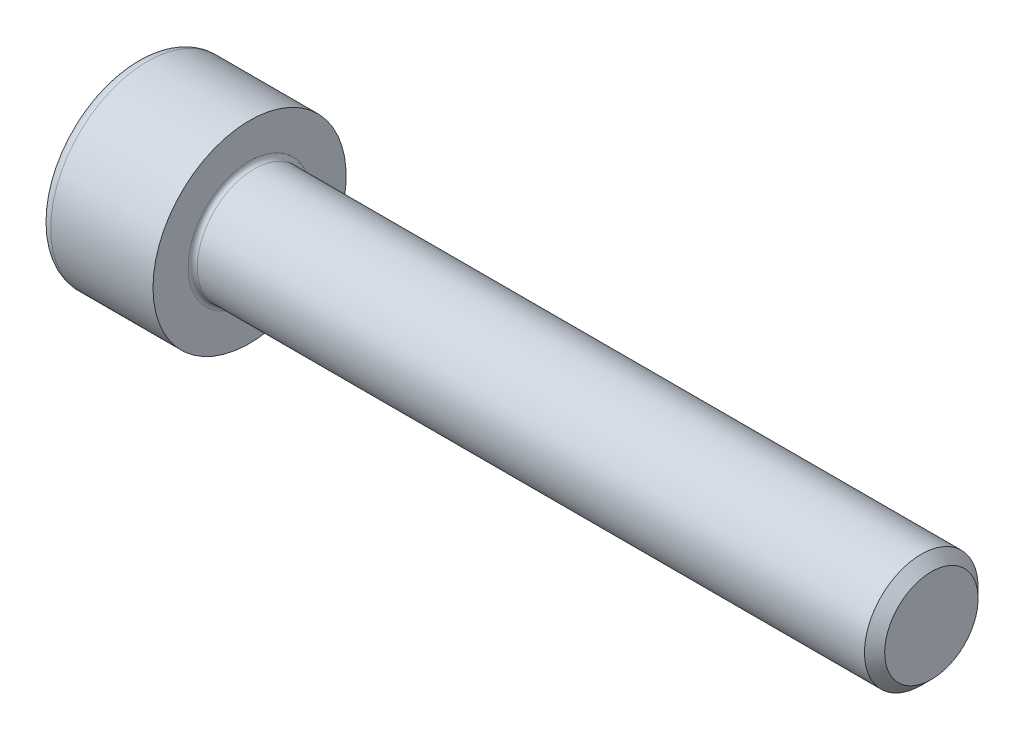
ISO-10303-21;
HEADER;
FILE_DESCRIPTION(('STEP AP214'),'2;1');
FILE_NAME('part.step','',(''),(''),'','','');
FILE_SCHEMA(('AUTOMOTIVE_DESIGN { 1 0 10303 214 1 1 1 1 }'));
ENDSEC;
DATA;
#1=APPLICATION_CONTEXT('core data for automotive mechanical design processes');
#2=APPLICATION_PROTOCOL_DEFINITION('international standard','automotive_design',2000,#1);
#3=PRODUCT_CONTEXT('',#1,'mechanical');
#4=PRODUCT('Part','Part','',(#3));
#5=PRODUCT_RELATED_PRODUCT_CATEGORY('part','',(#4));
#6=PRODUCT_DEFINITION_FORMATION('','',#4);
#7=PRODUCT_DEFINITION_CONTEXT('part definition',#1,'design');
#8=PRODUCT_DEFINITION('design','',#6,#7);
#9=PRODUCT_DEFINITION_SHAPE('','',#8);
#10=(LENGTH_UNIT() NAMED_UNIT(*) SI_UNIT(.MILLI.,.METRE.));
#11=(NAMED_UNIT(*) PLANE_ANGLE_UNIT() SI_UNIT($,.RADIAN.));
#12=(NAMED_UNIT(*) SI_UNIT($,.STERADIAN.) SOLID_ANGLE_UNIT());
#13=UNCERTAINTY_MEASURE_WITH_UNIT(LENGTH_MEASURE(1.E-05),#10,'distance_accuracy_value','');
#14=(GEOMETRIC_REPRESENTATION_CONTEXT(3) GLOBAL_UNCERTAINTY_ASSIGNED_CONTEXT((#13)) GLOBAL_UNIT_ASSIGNED_CONTEXT((#10,
#11,#12)) REPRESENTATION_CONTEXT('',''));
#15=CARTESIAN_POINT('',(0.,0.,0.));
#16=DIRECTION('',(0.,0.,1.));
#17=DIRECTION('',(1.,0.,0.));
#18=AXIS2_PLACEMENT_3D('',#15,#16,#17);
#19=CARTESIAN_POINT('',(0.,0.,0.));
#20=DIRECTION('',(-1.,0.,0.));
#21=DIRECTION('',(0.,0.,1.));
#22=AXIS2_PLACEMENT_3D('',#19,#20,#21);
#23=PLANE('',#22);
#24=DIRECTION('',(0.,-0.499999999999998,0.86602540378444));
#25=VECTOR('',#24,1.);
#26=CARTESIAN_POINT('',(0.,2.32094808214229,0.));
#27=LINE('',#26,#25);
#28=CARTESIAN_POINT('',(0.,2.32094808214229,0.));
#29=VERTEX_POINT('',#28);
#30=CARTESIAN_POINT('',(0.,1.16047404107115,2.01));
#31=VERTEX_POINT('',#30);
#32=EDGE_CURVE('E262',#29,#31,#27,.T.);
#33=ORIENTED_EDGE('',*,*,#32,.T.);
#34=DIRECTION('',(0.,1.,0.));
#35=VECTOR('',#34,1.);
#36=CARTESIAN_POINT('',(0.,-1.16047404107115,2.01));
#37=LINE('',#36,#35);
#38=CARTESIAN_POINT('',(0.,-1.16047404107115,2.01));
#39=VERTEX_POINT('',#38);
#40=EDGE_CURVE('E134',#39,#31,#37,.T.);
#41=ORIENTED_EDGE('',*,*,#40,.F.);
#42=DIRECTION('',(0.,-0.500000000000001,-0.866025403784438));
#43=VECTOR('',#42,1.);
#44=CARTESIAN_POINT('',(0.,-1.16047404107115,2.01));
#45=LINE('',#44,#43);
#46=CARTESIAN_POINT('',(0.,-2.3209480821423,0.));
#47=VERTEX_POINT('',#46);
#48=EDGE_CURVE('E265',#39,#47,#45,.T.);
#49=ORIENTED_EDGE('',*,*,#48,.T.);
#50=DIRECTION('',(0.,0.499999999999998,-0.86602540378444));
#51=VECTOR('',#50,1.);
#52=CARTESIAN_POINT('',(0.,-2.3209480821423,0.));
#53=LINE('',#52,#51);
#54=CARTESIAN_POINT('',(0.,-1.16047404107116,-2.01));
#55=VERTEX_POINT('',#54);
#56=EDGE_CURVE('E268',#47,#55,#53,.T.);
#57=ORIENTED_EDGE('',*,*,#56,.T.);
#58=DIRECTION('',(0.,-1.,0.));
#59=VECTOR('',#58,1.);
#60=CARTESIAN_POINT('',(0.,1.16047404107114,-2.01));
#61=LINE('',#60,#59);
#62=CARTESIAN_POINT('',(0.,1.16047404107114,-2.01));
#63=VERTEX_POINT('',#62);
#64=EDGE_CURVE('E271',#63,#55,#61,.T.);
#65=ORIENTED_EDGE('',*,*,#64,.F.);
#66=DIRECTION('',(0.,-0.500000000000001,-0.866025403784438));
#67=VECTOR('',#66,1.);
#68=CARTESIAN_POINT('',(0.,2.32094808214229,0.));
#69=LINE('',#68,#67);
#70=EDGE_CURVE('E129',#29,#63,#69,.T.);
#71=ORIENTED_EDGE('',*,*,#70,.F.);
#72=EDGE_LOOP('',(#33,#41,#49,#57,#65,#71));
#73=FACE_BOUND('',#72,.T.);
#74=CARTESIAN_POINT('',(0.,0.,0.));
#75=DIRECTION('',(-1.,0.,0.));
#76=DIRECTION('',(0.,0.,1.));
#77=AXIS2_PLACEMENT_3D('',#74,#75,#76);
#78=CIRCLE('',#77,3.75);
#79=CARTESIAN_POINT('',(0.,0.,3.75));
#80=VERTEX_POINT('',#79);
#81=EDGE_CURVE('E46',#80,#80,#78,.T.);
#82=ORIENTED_EDGE('',*,*,#81,.T.);
#83=EDGE_LOOP('',(#82));
#84=FACE_BOUND('',#83,.T.);
#85=ADVANCED_FACE('F38',(#73,#84),#23,.T.);
#86=CARTESIAN_POINT('',(-31.75,0.,0.));
#87=DIRECTION('',(-1.,0.,0.));
#88=DIRECTION('',(0.,0.,1.));
#89=AXIS2_PLACEMENT_3D('',#86,#87,#88);
#90=CYLINDRICAL_SURFACE('',#89,4.25);
#91=CARTESIAN_POINT('',(0.5,0.,0.));
#92=DIRECTION('',(-1.,0.,0.));
#93=DIRECTION('',(0.,0.,1.));
#94=AXIS2_PLACEMENT_3D('',#91,#92,#93);
#95=CIRCLE('',#94,4.25);
#96=CARTESIAN_POINT('',(0.5,0.,4.25));
#97=VERTEX_POINT('',#96);
#98=EDGE_CURVE('E11',#97,#97,#95,.F.);
#99=ORIENTED_EDGE('',*,*,#98,.T.);
#100=EDGE_LOOP('',(#99));
#101=FACE_BOUND('',#100,.T.);
#102=CARTESIAN_POINT('',(5.,0.,0.));
#103=DIRECTION('',(-1.,0.,0.));
#104=DIRECTION('',(0.,0.,1.));
#105=AXIS2_PLACEMENT_3D('',#102,#103,#104);
#106=CIRCLE('',#105,4.25);
#107=CARTESIAN_POINT('',(5.,0.,4.25));
#108=VERTEX_POINT('',#107);
#109=EDGE_CURVE('E152',#108,#108,#106,.T.);
#110=ORIENTED_EDGE('',*,*,#109,.T.);
#111=EDGE_LOOP('',(#110));
#112=FACE_BOUND('',#111,.T.);
#113=ADVANCED_FACE('F176',(#101,#112),#90,.T.);
#114=CARTESIAN_POINT('',(5.,4.25,0.));
#115=DIRECTION('',(1.,0.,0.));
#116=DIRECTION('',(0.,0.,-1.));
#117=AXIS2_PLACEMENT_3D('',#114,#115,#116);
#118=PLANE('',#117);
#119=CARTESIAN_POINT('',(5.,0.,0.));
#120=DIRECTION('',(1.,0.,0.));
#121=DIRECTION('',(0.,0.,-1.));
#122=AXIS2_PLACEMENT_3D('',#119,#120,#121);
#123=CIRCLE('',#122,2.69999999999999);
#124=CARTESIAN_POINT('',(5.,0.,-2.69999999999999));
#125=VERTEX_POINT('',#124);
#126=EDGE_CURVE('E155',#125,#125,#123,.F.);
#127=ORIENTED_EDGE('',*,*,#126,.T.);
#128=EDGE_LOOP('',(#127));
#129=FACE_BOUND('',#128,.T.);
#130=ORIENTED_EDGE('',*,*,#109,.F.);
#131=EDGE_LOOP('',(#130));
#132=FACE_BOUND('',#131,.T.);
#133=ADVANCED_FACE('F182',(#129,#132),#118,.T.);
#134=CARTESIAN_POINT('',(-31.75,0.,0.));
#135=DIRECTION('',(-1.,0.,0.));
#136=DIRECTION('',(0.,0.,1.));
#137=AXIS2_PLACEMENT_3D('',#134,#135,#136);
#138=CYLINDRICAL_SURFACE('',#137,2.49999999999999);
#139=CARTESIAN_POINT('',(5.2,0.,0.));
#140=DIRECTION('',(1.,0.,0.));
#141=DIRECTION('',(0.,0.,-1.));
#142=AXIS2_PLACEMENT_3D('',#139,#140,#141);
#143=CIRCLE('',#142,2.49999999999999);
#144=CARTESIAN_POINT('',(5.2,0.,-2.49999999999999));
#145=VERTEX_POINT('',#144);
#146=EDGE_CURVE('E158',#145,#145,#143,.T.);
#147=ORIENTED_EDGE('',*,*,#146,.T.);
#148=EDGE_LOOP('',(#147));
#149=FACE_BOUND('',#148,.T.);
#150=CARTESIAN_POINT('',(34.555,0.,0.));
#151=DIRECTION('',(-1.,0.,0.));
#152=DIRECTION('',(0.,0.,1.));
#153=AXIS2_PLACEMENT_3D('',#150,#151,#152);
#154=CIRCLE('',#153,2.49999999999999);
#155=CARTESIAN_POINT('',(34.555,0.,2.49999999999999));
#156=VERTEX_POINT('',#155);
#157=EDGE_CURVE('E149',#156,#156,#154,.T.);
#158=ORIENTED_EDGE('',*,*,#157,.T.);
#159=EDGE_LOOP('',(#158));
#160=FACE_BOUND('',#159,.T.);
#161=ADVANCED_FACE('F188',(#149,#160),#138,.T.);
#162=CARTESIAN_POINT('',(35.,0.,0.));
#163=DIRECTION('',(-1.,0.,0.));
#164=DIRECTION('',(0.,0.,1.));
#165=AXIS2_PLACEMENT_3D('',#162,#163,#164);
#166=CONICAL_SURFACE('',#165,2.055,0.785398163397432);
#167=ORIENTED_EDGE('',*,*,#157,.F.);
#168=EDGE_LOOP('',(#167));
#169=FACE_BOUND('',#168,.T.);
#170=CARTESIAN_POINT('',(35.,0.,0.));
#171=DIRECTION('',(-1.,0.,0.));
#172=DIRECTION('',(0.,0.,1.));
#173=AXIS2_PLACEMENT_3D('',#170,#171,#172);
#174=CIRCLE('',#173,2.055);
#175=CARTESIAN_POINT('',(35.,0.,2.055));
#176=VERTEX_POINT('',#175);
#177=EDGE_CURVE('E145',#176,#176,#174,.T.);
#178=ORIENTED_EDGE('',*,*,#177,.T.);
#179=EDGE_LOOP('',(#178));
#180=FACE_BOUND('',#179,.T.);
#181=ADVANCED_FACE('F192',(#169,#180),#166,.T.);
#182=CARTESIAN_POINT('',(35.,2.055,0.));
#183=DIRECTION('',(1.,0.,0.));
#184=DIRECTION('',(0.,0.,-1.));
#185=AXIS2_PLACEMENT_3D('',#182,#183,#184);
#186=PLANE('',#185);
#187=ORIENTED_EDGE('',*,*,#177,.F.);
#188=EDGE_LOOP('',(#187));
#189=FACE_BOUND('',#188,.T.);
#190=ADVANCED_FACE('F172',(#189),#186,.T.);
#191=CARTESIAN_POINT('',(5.2,0.,0.));
#192=DIRECTION('',(1.,0.,0.));
#193=DIRECTION('',(0.,0.,-1.));
#194=AXIS2_PLACEMENT_3D('',#191,#192,#193);
#195=TOROIDAL_SURFACE('',#194,2.69999999999999,0.2);
#196=ORIENTED_EDGE('',*,*,#146,.F.);
#197=EDGE_LOOP('',(#196));
#198=FACE_BOUND('',#197,.T.);
#199=ORIENTED_EDGE('',*,*,#126,.F.);
#200=EDGE_LOOP('',(#199));
#201=FACE_BOUND('',#200,.T.);
#202=ADVANCED_FACE('F165',(#198,#201),#195,.F.);
#203=CARTESIAN_POINT('',(0.5,0.,0.));
#204=DIRECTION('',(-1.,0.,0.));
#205=DIRECTION('',(0.,0.,1.));
#206=AXIS2_PLACEMENT_3D('',#203,#204,#205);
#207=TOROIDAL_SURFACE('',#206,3.75,0.5);
#208=ORIENTED_EDGE('',*,*,#98,.F.);
#209=EDGE_LOOP('',(#208));
#210=FACE_BOUND('',#209,.T.);
#211=ORIENTED_EDGE('',*,*,#81,.F.);
#212=EDGE_LOOP('',(#211));
#213=FACE_BOUND('',#212,.T.);
#214=ADVANCED_FACE('F40',(#210,#213),#207,.T.);
#215=CARTESIAN_POINT('',(2.5,2.32094808214229,0.));
#216=DIRECTION('',(0.,-0.86602540378444,-0.499999999999998));
#217=DIRECTION('',(0.,0.499999999999998,-0.86602540378444));
#218=AXIS2_PLACEMENT_3D('',#215,#216,#217);
#219=PLANE('',#218);
#220=ORIENTED_EDGE('',*,*,#32,.F.);
#221=DIRECTION('',(-1.,0.,0.));
#222=VECTOR('',#221,1.);
#223=CARTESIAN_POINT('',(2.5,2.32094808214229,0.));
#224=LINE('',#223,#222);
#225=CARTESIAN_POINT('',(2.5,2.32094808214229,0.));
#226=VERTEX_POINT('',#225);
#227=EDGE_CURVE('E252',#226,#29,#224,.T.);
#228=ORIENTED_EDGE('',*,*,#227,.F.);
#229=DIRECTION('',(0.,-0.499999999999998,0.86602540378444));
#230=VECTOR('',#229,1.);
#231=CARTESIAN_POINT('',(2.5,2.32094808214229,0.));
#232=LINE('',#231,#230);
#233=CARTESIAN_POINT('',(2.5,1.74071106160672,1.00499999999999));
#234=VERTEX_POINT('',#233);
#235=EDGE_CURVE('E121',#226,#234,#232,.T.);
#236=ORIENTED_EDGE('',*,*,#235,.T.);
#237=CARTESIAN_POINT('',(2.5,1.16047404107115,2.01));
#238=VERTEX_POINT('',#237);
#239=EDGE_CURVE('E112',#234,#238,#232,.T.);
#240=ORIENTED_EDGE('',*,*,#239,.T.);
#241=DIRECTION('',(-1.,0.,0.));
#242=VECTOR('',#241,1.);
#243=CARTESIAN_POINT('',(2.5,1.16047404107115,2.01));
#244=LINE('',#243,#242);
#245=EDGE_CURVE('E126',#238,#31,#244,.T.);
#246=ORIENTED_EDGE('',*,*,#245,.T.);
#247=EDGE_LOOP('',(#220,#228,#236,#240,#246));
#248=FACE_BOUND('',#247,.T.);
#249=ADVANCED_FACE('F125',(#248),#219,.T.);
#250=CARTESIAN_POINT('',(2.5,-1.16047404107115,2.01));
#251=DIRECTION('',(0.,0.,1.));
#252=DIRECTION('',(0.,-1.,0.));
#253=AXIS2_PLACEMENT_3D('',#250,#251,#252);
#254=PLANE('',#253);
#255=ORIENTED_EDGE('',*,*,#40,.T.);
#256=ORIENTED_EDGE('',*,*,#245,.F.);
#257=DIRECTION('',(0.,1.,0.));
#258=VECTOR('',#257,1.);
#259=CARTESIAN_POINT('',(2.5,-1.16047404107115,2.01));
#260=LINE('',#259,#258);
#261=CARTESIAN_POINT('',(2.5,0.,2.01));
#262=VERTEX_POINT('',#261);
#263=EDGE_CURVE('E109',#262,#238,#260,.T.);
#264=ORIENTED_EDGE('',*,*,#263,.F.);
#265=CARTESIAN_POINT('',(2.5,-1.16047404107115,2.01));
#266=VERTEX_POINT('',#265);
#267=EDGE_CURVE('E120',#266,#262,#260,.T.);
#268=ORIENTED_EDGE('',*,*,#267,.F.);
#269=DIRECTION('',(-1.,0.,0.));
#270=VECTOR('',#269,1.);
#271=CARTESIAN_POINT('',(2.5,-1.16047404107115,2.01));
#272=LINE('',#271,#270);
#273=EDGE_CURVE('E136',#266,#39,#272,.T.);
#274=ORIENTED_EDGE('',*,*,#273,.T.);
#275=EDGE_LOOP('',(#255,#256,#264,#268,#274));
#276=FACE_BOUND('',#275,.T.);
#277=ADVANCED_FACE('F131',(#276),#254,.F.);
#278=CARTESIAN_POINT('',(2.5,-1.16047404107115,2.01));
#279=DIRECTION('',(0.,0.866025403784438,-0.500000000000001));
#280=DIRECTION('',(0.,0.500000000000001,0.866025403784438));
#281=AXIS2_PLACEMENT_3D('',#278,#279,#280);
#282=PLANE('',#281);
#283=ORIENTED_EDGE('',*,*,#48,.F.);
#284=ORIENTED_EDGE('',*,*,#273,.F.);
#285=DIRECTION('',(0.,-0.500000000000001,-0.866025403784438));
#286=VECTOR('',#285,1.);
#287=CARTESIAN_POINT('',(2.5,-1.16047404107115,2.01));
#288=LINE('',#287,#286);
#289=CARTESIAN_POINT('',(2.5,-1.74071106160672,1.005));
#290=VERTEX_POINT('',#289);
#291=EDGE_CURVE('E291',#266,#290,#288,.T.);
#292=ORIENTED_EDGE('',*,*,#291,.T.);
#293=CARTESIAN_POINT('',(2.5,-2.3209480821423,0.));
#294=VERTEX_POINT('',#293);
#295=EDGE_CURVE('E280',#290,#294,#288,.T.);
#296=ORIENTED_EDGE('',*,*,#295,.T.);
#297=DIRECTION('',(-1.,0.,0.));
#298=VECTOR('',#297,1.);
#299=CARTESIAN_POINT('',(2.5,-2.3209480821423,0.));
#300=LINE('',#299,#298);
#301=EDGE_CURVE('E141',#294,#47,#300,.T.);
#302=ORIENTED_EDGE('',*,*,#301,.T.);
#303=EDGE_LOOP('',(#283,#284,#292,#296,#302));
#304=FACE_BOUND('',#303,.T.);
#305=ADVANCED_FACE('F206',(#304),#282,.T.);
#306=CARTESIAN_POINT('',(2.5,-2.3209480821423,0.));
#307=DIRECTION('',(0.,0.86602540378444,0.499999999999998));
#308=DIRECTION('',(0.,-0.499999999999998,0.86602540378444));
#309=AXIS2_PLACEMENT_3D('',#306,#307,#308);
#310=PLANE('',#309);
#311=ORIENTED_EDGE('',*,*,#56,.F.);
#312=ORIENTED_EDGE('',*,*,#301,.F.);
#313=DIRECTION('',(0.,0.499999999999998,-0.86602540378444));
#314=VECTOR('',#313,1.);
#315=CARTESIAN_POINT('',(2.5,-2.3209480821423,0.));
#316=LINE('',#315,#314);
#317=CARTESIAN_POINT('',(2.5,-1.74071106160673,-1.005));
#318=VERTEX_POINT('',#317);
#319=EDGE_CURVE('E258',#294,#318,#316,.T.);
#320=ORIENTED_EDGE('',*,*,#319,.T.);
#321=CARTESIAN_POINT('',(2.5,-1.16047404107116,-2.01));
#322=VERTEX_POINT('',#321);
#323=EDGE_CURVE('E290',#318,#322,#316,.T.);
#324=ORIENTED_EDGE('',*,*,#323,.T.);
#325=DIRECTION('',(-1.,0.,0.));
#326=VECTOR('',#325,1.);
#327=CARTESIAN_POINT('',(2.5,-1.16047404107116,-2.01));
#328=LINE('',#327,#326);
#329=EDGE_CURVE('E251',#322,#55,#328,.T.);
#330=ORIENTED_EDGE('',*,*,#329,.T.);
#331=EDGE_LOOP('',(#311,#312,#320,#324,#330));
#332=FACE_BOUND('',#331,.T.);
#333=ADVANCED_FACE('F209',(#332),#310,.T.);
#334=CARTESIAN_POINT('',(2.5,1.16047404107114,-2.01));
#335=DIRECTION('',(0.,0.,-1.));
#336=DIRECTION('',(0.,1.,0.));
#337=AXIS2_PLACEMENT_3D('',#334,#335,#336);
#338=PLANE('',#337);
#339=ORIENTED_EDGE('',*,*,#64,.T.);
#340=ORIENTED_EDGE('',*,*,#329,.F.);
#341=DIRECTION('',(0.,-1.,0.));
#342=VECTOR('',#341,1.);
#343=CARTESIAN_POINT('',(2.5,1.16047404107114,-2.01));
#344=LINE('',#343,#342);
#345=CARTESIAN_POINT('',(2.5,0.,-2.01));
#346=VERTEX_POINT('',#345);
#347=EDGE_CURVE('E255',#346,#322,#344,.T.);
#348=ORIENTED_EDGE('',*,*,#347,.F.);
#349=CARTESIAN_POINT('',(2.5,1.16047404107114,-2.01));
#350=VERTEX_POINT('',#349);
#351=EDGE_CURVE('E53',#350,#346,#344,.T.);
#352=ORIENTED_EDGE('',*,*,#351,.F.);
#353=DIRECTION('',(-1.,0.,0.));
#354=VECTOR('',#353,1.);
#355=CARTESIAN_POINT('',(2.5,1.16047404107114,-2.01));
#356=LINE('',#355,#354);
#357=EDGE_CURVE('E248',#350,#63,#356,.T.);
#358=ORIENTED_EDGE('',*,*,#357,.T.);
#359=EDGE_LOOP('',(#339,#340,#348,#352,#358));
#360=FACE_BOUND('',#359,.T.);
#361=ADVANCED_FACE('F213',(#360),#338,.F.);
#362=CARTESIAN_POINT('',(2.5,2.32094808214229,0.));
#363=DIRECTION('',(0.,0.866025403784438,-0.500000000000001));
#364=DIRECTION('',(0.,0.500000000000001,0.866025403784438));
#365=AXIS2_PLACEMENT_3D('',#362,#363,#364);
#366=PLANE('',#365);
#367=ORIENTED_EDGE('',*,*,#70,.T.);
#368=ORIENTED_EDGE('',*,*,#357,.F.);
#369=DIRECTION('',(0.,-0.500000000000001,-0.866025403784438));
#370=VECTOR('',#369,1.);
#371=CARTESIAN_POINT('',(2.5,2.32094808214229,0.));
#372=LINE('',#371,#370);
#373=CARTESIAN_POINT('',(2.5,1.74071106160671,-1.005));
#374=VERTEX_POINT('',#373);
#375=EDGE_CURVE('E238',#374,#350,#372,.T.);
#376=ORIENTED_EDGE('',*,*,#375,.F.);
#377=EDGE_CURVE('E244',#226,#374,#372,.T.);
#378=ORIENTED_EDGE('',*,*,#377,.F.);
#379=ORIENTED_EDGE('',*,*,#227,.T.);
#380=EDGE_LOOP('',(#367,#368,#376,#378,#379));
#381=FACE_BOUND('',#380,.T.);
#382=ADVANCED_FACE('F217',(#381),#366,.F.);
#383=CARTESIAN_POINT('',(2.5,3.48142212321343,-2.01000000000001));
#384=DIRECTION('',(1.,0.,0.));
#385=DIRECTION('',(0.,0.,-1.));
#386=AXIS2_PLACEMENT_3D('',#383,#384,#385);
#387=PLANE('',#386);
#388=ORIENTED_EDGE('',*,*,#347,.T.);
#389=ORIENTED_EDGE('',*,*,#323,.F.);
#390=CARTESIAN_POINT('',(2.5,0.,0.));
#391=DIRECTION('',(-1.,0.,0.));
#392=DIRECTION('',(0.,0.,1.));
#393=AXIS2_PLACEMENT_3D('',#390,#391,#392);
#394=CIRCLE('',#393,2.01);
#395=EDGE_CURVE('E286',#346,#318,#394,.T.);
#396=ORIENTED_EDGE('',*,*,#395,.F.);
#397=EDGE_LOOP('',(#388,#389,#396));
#398=FACE_BOUND('',#397,.T.);
#399=ADVANCED_FACE('F221',(#398),#387,.F.);
#400=ORIENTED_EDGE('',*,*,#319,.F.);
#401=ORIENTED_EDGE('',*,*,#295,.F.);
#402=EDGE_CURVE('E139',#318,#290,#394,.T.);
#403=ORIENTED_EDGE('',*,*,#402,.F.);
#404=EDGE_LOOP('',(#400,#401,#403));
#405=FACE_BOUND('',#404,.T.);
#406=ADVANCED_FACE('F224',(#405),#387,.F.);
#407=ORIENTED_EDGE('',*,*,#291,.F.);
#408=ORIENTED_EDGE('',*,*,#267,.T.);
#409=EDGE_CURVE('E135',#290,#262,#394,.T.);
#410=ORIENTED_EDGE('',*,*,#409,.F.);
#411=EDGE_LOOP('',(#407,#408,#410));
#412=FACE_BOUND('',#411,.T.);
#413=ADVANCED_FACE('F229',(#412),#387,.F.);
#414=ORIENTED_EDGE('',*,*,#263,.T.);
#415=ORIENTED_EDGE('',*,*,#239,.F.);
#416=EDGE_CURVE('E115',#262,#234,#394,.T.);
#417=ORIENTED_EDGE('',*,*,#416,.F.);
#418=EDGE_LOOP('',(#414,#415,#417));
#419=FACE_BOUND('',#418,.T.);
#420=ADVANCED_FACE('F111',(#419),#387,.F.);
#421=ORIENTED_EDGE('',*,*,#235,.F.);
#422=ORIENTED_EDGE('',*,*,#377,.T.);
#423=EDGE_CURVE('E146',#234,#374,#394,.T.);
#424=ORIENTED_EDGE('',*,*,#423,.F.);
#425=EDGE_LOOP('',(#421,#422,#424));
#426=FACE_BOUND('',#425,.T.);
#427=ADVANCED_FACE('F232',(#426),#387,.F.);
#428=ORIENTED_EDGE('',*,*,#375,.T.);
#429=ORIENTED_EDGE('',*,*,#351,.T.);
#430=EDGE_CURVE('E241',#374,#346,#394,.T.);
#431=ORIENTED_EDGE('',*,*,#430,.F.);
#432=EDGE_LOOP('',(#428,#429,#431));
#433=FACE_BOUND('',#432,.T.);
#434=ADVANCED_FACE('F202',(#433),#387,.F.);
#435=CARTESIAN_POINT('',(2.5,0.,0.));
#436=DIRECTION('',(-1.,0.,0.));
#437=DIRECTION('',(0.,0.,1.));
#438=AXIS2_PLACEMENT_3D('',#435,#436,#437);
#439=CONICAL_SURFACE('',#438,2.01,1.04719755119659);
#440=CARTESIAN_POINT('',(3.66047404107116,0.,0.));
#441=VERTEX_POINT('',#440);
#442=VERTEX_LOOP('',#441);
#443=FACE_BOUND('',#442,.T.);
#444=ORIENTED_EDGE('',*,*,#416,.T.);
#445=ORIENTED_EDGE('',*,*,#423,.T.);
#446=ORIENTED_EDGE('',*,*,#430,.T.);
#447=ORIENTED_EDGE('',*,*,#395,.T.);
#448=ORIENTED_EDGE('',*,*,#402,.T.);
#449=ORIENTED_EDGE('',*,*,#409,.T.);
#450=EDGE_LOOP('',(#444,#445,#446,#447,#448,#449));
#451=FACE_BOUND('',#450,.T.);
#452=ADVANCED_FACE('F200',(#443,#451),#439,.F.);
#453=CLOSED_SHELL('',(#85,#113,#133,#161,#181,#190,#202,#214,#249,#277,#305,#333,#361,#382,#399,
#406,#413,#420,#427,#434,#452));
#454=MANIFOLD_SOLID_BREP('B2',#453);
#455=ADVANCED_BREP_SHAPE_REPRESENTATION('',(#18,#454),#14);
#456=SHAPE_DEFINITION_REPRESENTATION(#9,#455);
ENDSEC;
END-ISO-10303-21;
